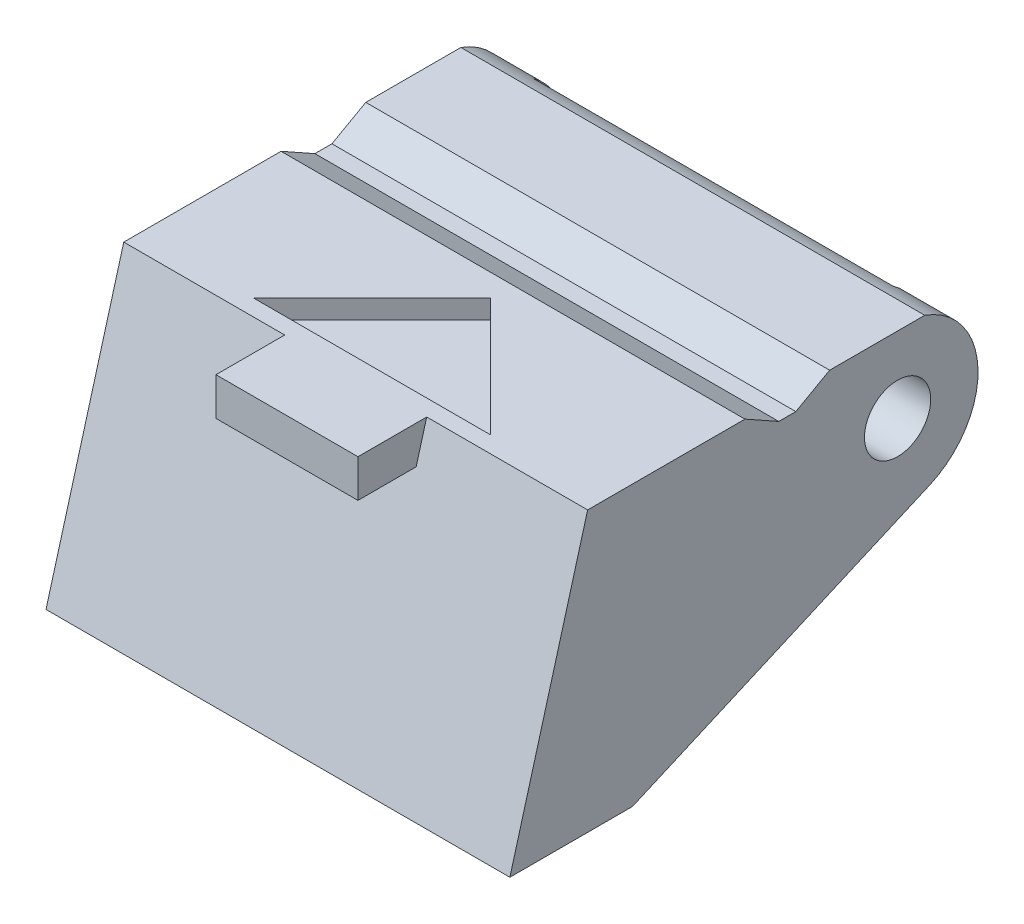
ISO-10303-21;
HEADER;
FILE_DESCRIPTION(('STEP AP214'),'2;1');
FILE_NAME('part.step','',(''),(''),'','','');
FILE_SCHEMA(('AUTOMOTIVE_DESIGN { 1 0 10303 214 1 1 1 1 }'));
ENDSEC;
DATA;
#1=APPLICATION_CONTEXT('core data for automotive mechanical design processes');
#2=APPLICATION_PROTOCOL_DEFINITION('international standard','automotive_design',2000,#1);
#3=PRODUCT_CONTEXT('',#1,'mechanical');
#4=PRODUCT('Part','Part','',(#3));
#5=PRODUCT_RELATED_PRODUCT_CATEGORY('part','',(#4));
#6=PRODUCT_DEFINITION_FORMATION('','',#4);
#7=PRODUCT_DEFINITION_CONTEXT('part definition',#1,'design');
#8=PRODUCT_DEFINITION('design','',#6,#7);
#9=PRODUCT_DEFINITION_SHAPE('','',#8);
#10=(LENGTH_UNIT() NAMED_UNIT(*) SI_UNIT(.MILLI.,.METRE.));
#11=(NAMED_UNIT(*) PLANE_ANGLE_UNIT() SI_UNIT($,.RADIAN.));
#12=(NAMED_UNIT(*) SI_UNIT($,.STERADIAN.) SOLID_ANGLE_UNIT());
#13=UNCERTAINTY_MEASURE_WITH_UNIT(LENGTH_MEASURE(1.E-05),#10,'distance_accuracy_value','');
#14=(GEOMETRIC_REPRESENTATION_CONTEXT(3) GLOBAL_UNCERTAINTY_ASSIGNED_CONTEXT((#13)) GLOBAL_UNIT_ASSIGNED_CONTEXT((#10,
#11,#12)) REPRESENTATION_CONTEXT('',''));
#15=CARTESIAN_POINT('',(0.,0.,0.));
#16=DIRECTION('',(0.,0.,1.));
#17=DIRECTION('',(1.,0.,0.));
#18=AXIS2_PLACEMENT_3D('',#15,#16,#17);
#19=CARTESIAN_POINT('',(4.9,1.6,-1.7));
#20=DIRECTION('',(0.,-1.,0.));
#21=DIRECTION('',(0.,0.,-1.));
#22=AXIS2_PLACEMENT_3D('',#19,#20,#21);
#23=PLANE('',#22);
#24=DIRECTION('',(0.,0.,1.));
#25=VECTOR('',#24,1.);
#26=CARTESIAN_POINT('',(-4.9,1.6,-1.7));
#27=LINE('',#26,#25);
#28=CARTESIAN_POINT('',(-4.9,1.6,-0.574456264653803));
#29=VERTEX_POINT('',#28);
#30=CARTESIAN_POINT('',(-4.9,1.6,1.435));
#31=VERTEX_POINT('',#30);
#32=EDGE_CURVE('E188',#29,#31,#27,.T.);
#33=ORIENTED_EDGE('',*,*,#32,.T.);
#34=DIRECTION('',(1.,0.,0.));
#35=VECTOR('',#34,1.);
#36=CARTESIAN_POINT('',(-5.,1.6,1.435));
#37=LINE('',#36,#35);
#38=CARTESIAN_POINT('',(4.9,1.6,1.435));
#39=VERTEX_POINT('',#38);
#40=EDGE_CURVE('E293',#31,#39,#37,.T.);
#41=ORIENTED_EDGE('',*,*,#40,.T.);
#42=DIRECTION('',(0.,0.,1.));
#43=VECTOR('',#42,1.);
#44=CARTESIAN_POINT('',(4.9,1.6,-1.7));
#45=LINE('',#44,#43);
#46=CARTESIAN_POINT('',(4.9,1.6,-0.574456264653803));
#47=VERTEX_POINT('',#46);
#48=EDGE_CURVE('E278',#47,#39,#45,.T.);
#49=ORIENTED_EDGE('',*,*,#48,.F.);
#50=DIRECTION('',(-1.,0.,0.));
#51=VECTOR('',#50,1.);
#52=CARTESIAN_POINT('',(4.9,1.6,-0.574456264653803));
#53=LINE('',#52,#51);
#54=EDGE_CURVE('E265',#47,#29,#53,.T.);
#55=ORIENTED_EDGE('',*,*,#54,.T.);
#56=EDGE_LOOP('',(#33,#41,#49,#55));
#57=FACE_BOUND('',#56,.T.);
#58=ADVANCED_FACE('F16',(#57),#23,.F.);
#59=CARTESIAN_POINT('',(4.9,0.,0.));
#60=DIRECTION('',(-1.,0.,0.));
#61=DIRECTION('',(0.,0.,1.));
#62=AXIS2_PLACEMENT_3D('',#59,#60,#61);
#63=CYLINDRICAL_SURFACE('',#62,1.7);
#64=CARTESIAN_POINT('',(3.8,0.,0.));
#65=DIRECTION('',(1.,0.,0.));
#66=DIRECTION('',(0.,0.,-1.));
#67=AXIS2_PLACEMENT_3D('',#64,#65,#66);
#68=CIRCLE('',#67,1.7);
#69=CARTESIAN_POINT('',(3.8,-1.55797498876303,-0.680230794943039));
#70=VERTEX_POINT('',#69);
#71=CARTESIAN_POINT('',(3.8,1.38081445189058,-0.991640786499881));
#72=VERTEX_POINT('',#71);
#73=EDGE_CURVE('E255',#70,#72,#68,.T.);
#74=ORIENTED_EDGE('',*,*,#73,.T.);
#75=DIRECTION('',(-1.,0.,0.));
#76=VECTOR('',#75,1.);
#77=CARTESIAN_POINT('',(3.8,1.38081445189058,-0.991640786499881));
#78=LINE('',#77,#76);
#79=CARTESIAN_POINT('',(-3.8,1.38081445189058,-0.991640786499881));
#80=VERTEX_POINT('',#79);
#81=EDGE_CURVE('E232',#72,#80,#78,.T.);
#82=ORIENTED_EDGE('',*,*,#81,.T.);
#83=CARTESIAN_POINT('',(-3.8,0.,0.));
#84=DIRECTION('',(1.,0.,0.));
#85=DIRECTION('',(0.,0.,-1.));
#86=AXIS2_PLACEMENT_3D('',#83,#84,#85);
#87=CIRCLE('',#86,1.7);
#88=CARTESIAN_POINT('',(-3.8,-1.55797498876303,-0.680230794943039));
#89=VERTEX_POINT('',#88);
#90=EDGE_CURVE('E338',#89,#80,#87,.T.);
#91=ORIENTED_EDGE('',*,*,#90,.F.);
#92=DIRECTION('',(1.,0.,0.));
#93=VECTOR('',#92,1.);
#94=CARTESIAN_POINT('',(-4.9,-1.55797498876303,-0.680230794943039));
#95=LINE('',#94,#93);
#96=CARTESIAN_POINT('',(-4.9,-1.55797498876303,-0.680230794943039));
#97=VERTEX_POINT('',#96);
#98=EDGE_CURVE('E189',#97,#89,#95,.T.);
#99=ORIENTED_EDGE('',*,*,#98,.F.);
#100=CARTESIAN_POINT('',(-4.9,0.,0.));
#101=DIRECTION('',(-1.,0.,0.));
#102=DIRECTION('',(0.,0.,-1.));
#103=AXIS2_PLACEMENT_3D('',#100,#101,#102);
#104=CIRCLE('',#103,1.7);
#105=EDGE_CURVE('E347',#29,#97,#104,.T.);
#106=ORIENTED_EDGE('',*,*,#105,.F.);
#107=ORIENTED_EDGE('',*,*,#54,.F.);
#108=CARTESIAN_POINT('',(4.9,0.,0.));
#109=DIRECTION('',(-1.,0.,0.));
#110=DIRECTION('',(0.,0.,-1.));
#111=AXIS2_PLACEMENT_3D('',#108,#109,#110);
#112=CIRCLE('',#111,1.7);
#113=CARTESIAN_POINT('',(4.9,-1.55797498876303,-0.680230794943039));
#114=VERTEX_POINT('',#113);
#115=EDGE_CURVE('E267',#47,#114,#112,.T.);
#116=ORIENTED_EDGE('',*,*,#115,.T.);
#117=DIRECTION('',(-1.,0.,0.));
#118=VECTOR('',#117,1.);
#119=CARTESIAN_POINT('',(4.9,-1.55797498876303,-0.680230794943039));
#120=LINE('',#119,#118);
#121=EDGE_CURVE('E275',#114,#70,#120,.T.);
#122=ORIENTED_EDGE('',*,*,#121,.T.);
#123=EDGE_LOOP('',(#74,#82,#91,#99,#106,#107,#116,#122));
#124=FACE_BOUND('',#123,.T.);
#125=ADVANCED_FACE('F387',(#124),#63,.T.);
#126=CARTESIAN_POINT('',(3.8,0.799999999999999,5.94));
#127=DIRECTION('',(0.,-1.,0.));
#128=DIRECTION('',(0.,0.,-1.));
#129=AXIS2_PLACEMENT_3D('',#126,#127,#128);
#130=PLANE('',#129);
#131=DIRECTION('',(-1.,0.,0.));
#132=VECTOR('',#131,1.);
#133=CARTESIAN_POINT('',(3.8,0.799999999999999,5.94));
#134=LINE('',#133,#132);
#135=CARTESIAN_POINT('',(3.8,0.799999999999999,5.94));
#136=VERTEX_POINT('',#135);
#137=CARTESIAN_POINT('',(-3.8,0.799999999999999,5.94));
#138=VERTEX_POINT('',#137);
#139=EDGE_CURVE('E263',#136,#138,#134,.T.);
#140=ORIENTED_EDGE('',*,*,#139,.T.);
#141=DIRECTION('',(0.,0.,1.));
#142=VECTOR('',#141,1.);
#143=CARTESIAN_POINT('',(-3.8,0.799999999999999,5.94));
#144=LINE('',#143,#142);
#145=CARTESIAN_POINT('',(-3.8,0.799999999999999,0.0143593539448927));
#146=VERTEX_POINT('',#145);
#147=EDGE_CURVE('E341',#146,#138,#144,.T.);
#148=ORIENTED_EDGE('',*,*,#147,.F.);
#149=DIRECTION('',(-1.,0.,0.));
#150=VECTOR('',#149,1.);
#151=CARTESIAN_POINT('',(3.8,0.799999999999999,0.0143593539448927));
#152=LINE('',#151,#150);
#153=CARTESIAN_POINT('',(3.8,0.799999999999999,0.0143593539448927));
#154=VERTEX_POINT('',#153);
#155=EDGE_CURVE('E230',#154,#146,#152,.T.);
#156=ORIENTED_EDGE('',*,*,#155,.F.);
#157=DIRECTION('',(0.,0.,1.));
#158=VECTOR('',#157,1.);
#159=CARTESIAN_POINT('',(3.8,0.799999999999999,5.94));
#160=LINE('',#159,#158);
#161=EDGE_CURVE('E257',#154,#136,#160,.T.);
#162=ORIENTED_EDGE('',*,*,#161,.T.);
#163=EDGE_LOOP('',(#140,#148,#156,#162));
#164=FACE_BOUND('',#163,.T.);
#165=ADVANCED_FACE('F393',(#164),#130,.T.);
#166=CARTESIAN_POINT('',(4.9,1.6,-1.7));
#167=DIRECTION('',(-1.,0.,0.));
#168=DIRECTION('',(0.,0.,1.));
#169=AXIS2_PLACEMENT_3D('',#166,#167,#168);
#170=PLANE('',#169);
#171=ORIENTED_EDGE('',*,*,#48,.T.);
#172=DIRECTION('',(0.,-0.488231650079598,0.872714074517281));
#173=VECTOR('',#172,1.);
#174=CARTESIAN_POINT('',(4.9,2.93578159335544,-0.952709598122836));
#175=LINE('',#174,#173);
#176=CARTESIAN_POINT('',(4.9,1.2,2.15));
#177=VERTEX_POINT('',#176);
#178=EDGE_CURVE('E302',#39,#177,#175,.T.);
#179=ORIENTED_EDGE('',*,*,#178,.T.);
#180=DIRECTION('',(0.,0.,1.));
#181=VECTOR('',#180,1.);
#182=CARTESIAN_POINT('',(4.9,1.2,-1.7));
#183=LINE('',#182,#181);
#184=CARTESIAN_POINT('',(4.9,1.2,2.51));
#185=VERTEX_POINT('',#184);
#186=EDGE_CURVE('E290',#177,#185,#183,.T.);
#187=ORIENTED_EDGE('',*,*,#186,.T.);
#188=DIRECTION('',(0.,0.488231650079598,0.872714074517281));
#189=VECTOR('',#188,1.);
#190=CARTESIAN_POINT('',(4.9,-0.498476665797609,-0.526027040113224));
#191=LINE('',#190,#189);
#192=CARTESIAN_POINT('',(4.9,1.6,3.225));
#193=VERTEX_POINT('',#192);
#194=EDGE_CURVE('E296',#185,#193,#191,.T.);
#195=ORIENTED_EDGE('',*,*,#194,.T.);
#196=CARTESIAN_POINT('',(4.9,1.6,6.54768574116445));
#197=VERTEX_POINT('',#196);
#198=EDGE_CURVE('E180',#193,#197,#45,.T.);
#199=ORIENTED_EDGE('',*,*,#198,.T.);
#200=DIRECTION('',(0.,0.963355359932388,-0.268228355118429));
#201=VECTOR('',#200,1.);
#202=CARTESIAN_POINT('',(4.9,0.799999999999999,6.77043083920366));
#203=LINE('',#202,#201);
#204=CARTESIAN_POINT('',(4.9,-4.3,8.19043083920366));
#205=VERTEX_POINT('',#204);
#206=EDGE_CURVE('E242',#205,#197,#203,.T.);
#207=ORIENTED_EDGE('',*,*,#206,.F.);
#208=DIRECTION('',(0.,0.,-1.));
#209=VECTOR('',#208,1.);
#210=CARTESIAN_POINT('',(4.9,-4.3,-1.7));
#211=LINE('',#210,#209);
#212=CARTESIAN_POINT('',(4.9,-4.3,5.6));
#213=VERTEX_POINT('',#212);
#214=EDGE_CURVE('E172',#205,#213,#211,.T.);
#215=ORIENTED_EDGE('',*,*,#214,.T.);
#216=DIRECTION('',(0.,-0.4001357617312,0.916455875742958));
#217=VECTOR('',#216,1.);
#218=CARTESIAN_POINT('',(4.9,-4.3,5.6));
#219=LINE('',#218,#217);
#220=EDGE_CURVE('E269',#114,#213,#219,.T.);
#221=ORIENTED_EDGE('',*,*,#220,.F.);
#222=ORIENTED_EDGE('',*,*,#115,.F.);
#223=EDGE_LOOP('',(#171,#179,#187,#195,#199,#207,#215,#221,#222));
#224=FACE_BOUND('',#223,.T.);
#225=CARTESIAN_POINT('',(4.9,0.,0.));
#226=DIRECTION('',(1.,0.,0.));
#227=DIRECTION('',(0.,0.,-1.));
#228=AXIS2_PLACEMENT_3D('',#225,#226,#227);
#229=CIRCLE('',#228,0.7);
#230=CARTESIAN_POINT('',(4.9,0.,-0.7));
#231=VERTEX_POINT('',#230);
#232=EDGE_CURVE('E234',#231,#231,#229,.T.);
#233=ORIENTED_EDGE('',*,*,#232,.F.);
#234=EDGE_LOOP('',(#233));
#235=FACE_BOUND('',#234,.T.);
#236=ADVANCED_FACE('F379',(#224,#235),#170,.F.);
#237=CARTESIAN_POINT('',(3.8,0.,0.));
#238=DIRECTION('',(1.,0.,0.));
#239=DIRECTION('',(0.,0.,-1.));
#240=AXIS2_PLACEMENT_3D('',#237,#238,#239);
#241=PLANE('',#240);
#242=DIRECTION('',(0.,0.,-1.));
#243=VECTOR('',#242,1.);
#244=CARTESIAN_POINT('',(3.8,-4.3,7.36));
#245=LINE('',#244,#243);
#246=CARTESIAN_POINT('',(3.8,-4.3,7.36));
#247=VERTEX_POINT('',#246);
#248=CARTESIAN_POINT('',(3.8,-4.3,5.6));
#249=VERTEX_POINT('',#248);
#250=EDGE_CURVE('E249',#247,#249,#245,.T.);
#251=ORIENTED_EDGE('',*,*,#250,.F.);
#252=DIRECTION('',(0.,-0.963355359932388,0.268228355118429));
#253=VECTOR('',#252,1.);
#254=CARTESIAN_POINT('',(3.8,-4.3,7.36));
#255=LINE('',#254,#253);
#256=EDGE_CURVE('E259',#136,#247,#255,.T.);
#257=ORIENTED_EDGE('',*,*,#256,.F.);
#258=ORIENTED_EDGE('',*,*,#161,.F.);
#259=DIRECTION('',(0.,-0.499999999999995,0.866025403784441));
#260=VECTOR('',#259,1.);
#261=CARTESIAN_POINT('',(3.8,0.799999999999999,0.0143593539448927));
#262=LINE('',#261,#260);
#263=EDGE_CURVE('E228',#72,#154,#262,.T.);
#264=ORIENTED_EDGE('',*,*,#263,.F.);
#265=ORIENTED_EDGE('',*,*,#73,.F.);
#266=DIRECTION('',(0.,0.4001357617312,-0.916455875742958));
#267=VECTOR('',#266,1.);
#268=CARTESIAN_POINT('',(3.8,-1.55797498876303,-0.680230794943039));
#269=LINE('',#268,#267);
#270=EDGE_CURVE('E252',#249,#70,#269,.T.);
#271=ORIENTED_EDGE('',*,*,#270,.F.);
#272=EDGE_LOOP('',(#251,#257,#258,#264,#265,#271));
#273=FACE_BOUND('',#272,.T.);
#274=CARTESIAN_POINT('',(3.8,0.,0.));
#275=DIRECTION('',(1.,0.,0.));
#276=DIRECTION('',(0.,0.,-1.));
#277=AXIS2_PLACEMENT_3D('',#274,#275,#276);
#278=CIRCLE('',#277,0.7);
#279=CARTESIAN_POINT('',(3.8,0.,-0.7));
#280=VERTEX_POINT('',#279);
#281=EDGE_CURVE('E237',#280,#280,#278,.F.);
#282=ORIENTED_EDGE('',*,*,#281,.F.);
#283=EDGE_LOOP('',(#282));
#284=FACE_BOUND('',#283,.T.);
#285=ADVANCED_FACE('F396',(#273,#284),#241,.F.);
#286=DIRECTION('',(0.707106781186548,0.,-0.707106781186548));
#287=VECTOR('',#286,1.);
#288=CARTESIAN_POINT('',(0.,1.6,3.7));
#289=LINE('',#288,#287);
#290=CARTESIAN_POINT('',(-2.5,1.6,6.2));
#291=VERTEX_POINT('',#290);
#292=CARTESIAN_POINT('',(0.,1.6,3.7));
#293=VERTEX_POINT('',#292);
#294=EDGE_CURVE('E304',#291,#293,#289,.T.);
#295=ORIENTED_EDGE('',*,*,#294,.T.);
#296=DIRECTION('',(-0.707106781186548,0.,-0.707106781186548));
#297=VECTOR('',#296,1.);
#298=CARTESIAN_POINT('',(0.,1.6,3.7));
#299=LINE('',#298,#297);
#300=CARTESIAN_POINT('',(2.5,1.6,6.2));
#301=VERTEX_POINT('',#300);
#302=EDGE_CURVE('E200',#301,#293,#299,.T.);
#303=ORIENTED_EDGE('',*,*,#302,.F.);
#304=DIRECTION('',(1.,0.,0.));
#305=VECTOR('',#304,1.);
#306=CARTESIAN_POINT('',(2.5,1.6,6.2));
#307=LINE('',#306,#305);
#308=EDGE_CURVE('E207',#291,#301,#307,.T.);
#309=ORIENTED_EDGE('',*,*,#308,.F.);
#310=EDGE_LOOP('',(#295,#303,#309));
#311=FACE_BOUND('',#310,.T.);
#312=ORIENTED_EDGE('',*,*,#198,.F.);
#313=DIRECTION('',(1.,0.,0.));
#314=VECTOR('',#313,1.);
#315=CARTESIAN_POINT('',(-5.,1.6,3.225));
#316=LINE('',#315,#314);
#317=CARTESIAN_POINT('',(-4.9,1.6,3.225));
#318=VERTEX_POINT('',#317);
#319=EDGE_CURVE('E167',#318,#193,#316,.T.);
#320=ORIENTED_EDGE('',*,*,#319,.F.);
#321=CARTESIAN_POINT('',(-4.9,1.6,6.54768574116444));
#322=VERTEX_POINT('',#321);
#323=EDGE_CURVE('E177',#318,#322,#27,.T.);
#324=ORIENTED_EDGE('',*,*,#323,.T.);
#325=DIRECTION('',(-1.,0.,0.));
#326=VECTOR('',#325,1.);
#327=CARTESIAN_POINT('',(-1.5,1.6,6.54768574116445));
#328=LINE('',#327,#326);
#329=CARTESIAN_POINT('',(-1.5,1.6,6.54768574116445));
#330=VERTEX_POINT('',#329);
#331=EDGE_CURVE('E325',#330,#322,#328,.T.);
#332=ORIENTED_EDGE('',*,*,#331,.F.);
#333=DIRECTION('',(0.,0.,1.));
#334=VECTOR('',#333,1.);
#335=CARTESIAN_POINT('',(-1.5,1.6,6.54768574116445));
#336=LINE('',#335,#334);
#337=CARTESIAN_POINT('',(-1.5,1.6,8.));
#338=VERTEX_POINT('',#337);
#339=EDGE_CURVE('E319',#330,#338,#336,.T.);
#340=ORIENTED_EDGE('',*,*,#339,.T.);
#341=DIRECTION('',(-1.,0.,0.));
#342=VECTOR('',#341,1.);
#343=CARTESIAN_POINT('',(4.9,1.6,8.));
#344=LINE('',#343,#342);
#345=CARTESIAN_POINT('',(1.5,1.6,8.));
#346=VERTEX_POINT('',#345);
#347=EDGE_CURVE('E238',#346,#338,#344,.T.);
#348=ORIENTED_EDGE('',*,*,#347,.F.);
#349=DIRECTION('',(0.,0.,1.));
#350=VECTOR('',#349,1.);
#351=CARTESIAN_POINT('',(1.5,1.6,6.54768574116445));
#352=LINE('',#351,#350);
#353=CARTESIAN_POINT('',(1.5,1.6,6.54768574116445));
#354=VERTEX_POINT('',#353);
#355=EDGE_CURVE('E39',#354,#346,#352,.T.);
#356=ORIENTED_EDGE('',*,*,#355,.F.);
#357=DIRECTION('',(1.,0.,0.));
#358=VECTOR('',#357,1.);
#359=CARTESIAN_POINT('',(1.5,1.6,6.54768574116445));
#360=LINE('',#359,#358);
#361=EDGE_CURVE('E226',#354,#197,#360,.T.);
#362=ORIENTED_EDGE('',*,*,#361,.T.);
#363=EDGE_LOOP('',(#312,#320,#324,#332,#340,#348,#356,#362));
#364=FACE_BOUND('',#363,.T.);
#365=ADVANCED_FACE('F18',(#311,#364),#23,.F.);
#366=CARTESIAN_POINT('',(4.9,0.799999999999999,6.77043083920366));
#367=DIRECTION('',(0.,-1.,0.));
#368=DIRECTION('',(0.,0.,-1.));
#369=AXIS2_PLACEMENT_3D('',#366,#367,#368);
#370=PLANE('',#369);
#371=DIRECTION('',(0.,0.,-1.));
#372=VECTOR('',#371,1.);
#373=CARTESIAN_POINT('',(1.5,0.799999999999999,6.77043083920366));
#374=LINE('',#373,#372);
#375=CARTESIAN_POINT('',(1.5,0.799999999999999,8.));
#376=VERTEX_POINT('',#375);
#377=CARTESIAN_POINT('',(1.5,0.799999999999999,6.77043083920366));
#378=VERTEX_POINT('',#377);
#379=EDGE_CURVE('E218',#376,#378,#374,.T.);
#380=ORIENTED_EDGE('',*,*,#379,.F.);
#381=DIRECTION('',(-1.,0.,0.));
#382=VECTOR('',#381,1.);
#383=CARTESIAN_POINT('',(4.9,0.799999999999999,8.));
#384=LINE('',#383,#382);
#385=CARTESIAN_POINT('',(-1.5,0.799999999999999,8.));
#386=VERTEX_POINT('',#385);
#387=EDGE_CURVE('E240',#376,#386,#384,.T.);
#388=ORIENTED_EDGE('',*,*,#387,.T.);
#389=DIRECTION('',(0.,0.,-1.));
#390=VECTOR('',#389,1.);
#391=CARTESIAN_POINT('',(-1.5,0.799999999999999,6.77043083920366));
#392=LINE('',#391,#390);
#393=CARTESIAN_POINT('',(-1.5,0.799999999999999,6.77043083920366));
#394=VERTEX_POINT('',#393);
#395=EDGE_CURVE('E312',#386,#394,#392,.T.);
#396=ORIENTED_EDGE('',*,*,#395,.T.);
#397=DIRECTION('',(-1.,0.,0.));
#398=VECTOR('',#397,1.);
#399=CARTESIAN_POINT('',(4.9,0.799999999999999,6.77043083920366));
#400=LINE('',#399,#398);
#401=EDGE_CURVE('E245',#378,#394,#400,.T.);
#402=ORIENTED_EDGE('',*,*,#401,.F.);
#403=EDGE_LOOP('',(#380,#388,#396,#402));
#404=FACE_BOUND('',#403,.T.);
#405=ADVANCED_FACE('F420',(#404),#370,.T.);
#406=CARTESIAN_POINT('',(4.9,-4.3,-1.7));
#407=DIRECTION('',(0.,1.,0.));
#408=DIRECTION('',(0.,0.,1.));
#409=AXIS2_PLACEMENT_3D('',#406,#407,#408);
#410=PLANE('',#409);
#411=DIRECTION('',(-1.,0.,0.));
#412=VECTOR('',#411,1.);
#413=CARTESIAN_POINT('',(4.9,-4.3,8.19043083920366));
#414=LINE('',#413,#412);
#415=CARTESIAN_POINT('',(-4.9,-4.3,8.19043083920366));
#416=VERTEX_POINT('',#415);
#417=EDGE_CURVE('E247',#205,#416,#414,.T.);
#418=ORIENTED_EDGE('',*,*,#417,.T.);
#419=DIRECTION('',(0.,0.,-1.));
#420=VECTOR('',#419,1.);
#421=CARTESIAN_POINT('',(-4.9,-4.3,-1.7));
#422=LINE('',#421,#420);
#423=CARTESIAN_POINT('',(-4.9,-4.3,5.6));
#424=VERTEX_POINT('',#423);
#425=EDGE_CURVE('E192',#416,#424,#422,.T.);
#426=ORIENTED_EDGE('',*,*,#425,.T.);
#427=DIRECTION('',(1.,0.,0.));
#428=VECTOR('',#427,1.);
#429=CARTESIAN_POINT('',(-4.9,-4.3,5.6));
#430=LINE('',#429,#428);
#431=CARTESIAN_POINT('',(-3.8,-4.3,5.6));
#432=VERTEX_POINT('',#431);
#433=EDGE_CURVE('E194',#424,#432,#430,.T.);
#434=ORIENTED_EDGE('',*,*,#433,.T.);
#435=DIRECTION('',(0.,0.,-1.));
#436=VECTOR('',#435,1.);
#437=CARTESIAN_POINT('',(-3.8,-4.3,7.36));
#438=LINE('',#437,#436);
#439=CARTESIAN_POINT('',(-3.8,-4.3,7.36));
#440=VERTEX_POINT('',#439);
#441=EDGE_CURVE('E333',#440,#432,#438,.T.);
#442=ORIENTED_EDGE('',*,*,#441,.F.);
#443=DIRECTION('',(-1.,0.,0.));
#444=VECTOR('',#443,1.);
#445=CARTESIAN_POINT('',(3.8,-4.3,7.36));
#446=LINE('',#445,#444);
#447=EDGE_CURVE('E261',#247,#440,#446,.T.);
#448=ORIENTED_EDGE('',*,*,#447,.F.);
#449=ORIENTED_EDGE('',*,*,#250,.T.);
#450=DIRECTION('',(-1.,0.,0.));
#451=VECTOR('',#450,1.);
#452=CARTESIAN_POINT('',(4.9,-4.3,5.6));
#453=LINE('',#452,#451);
#454=EDGE_CURVE('E272',#213,#249,#453,.T.);
#455=ORIENTED_EDGE('',*,*,#454,.F.);
#456=ORIENTED_EDGE('',*,*,#214,.F.);
#457=EDGE_LOOP('',(#418,#426,#434,#442,#448,#449,#455,#456));
#458=FACE_BOUND('',#457,.T.);
#459=ADVANCED_FACE('F355',(#458),#410,.F.);
#460=CARTESIAN_POINT('',(4.9,-4.3,5.6));
#461=DIRECTION('',(0.,-0.916455875742958,-0.4001357617312));
#462=DIRECTION('',(0.,0.4001357617312,-0.916455875742958));
#463=AXIS2_PLACEMENT_3D('',#460,#461,#462);
#464=PLANE('',#463);
#465=ORIENTED_EDGE('',*,*,#270,.T.);
#466=ORIENTED_EDGE('',*,*,#121,.F.);
#467=ORIENTED_EDGE('',*,*,#220,.T.);
#468=ORIENTED_EDGE('',*,*,#454,.T.);
#469=EDGE_LOOP('',(#465,#466,#467,#468));
#470=FACE_BOUND('',#469,.T.);
#471=ADVANCED_FACE('F375',(#470),#464,.T.);
#472=CARTESIAN_POINT('',(3.8,-4.3,7.36));
#473=DIRECTION('',(0.,-0.268228355118429,-0.963355359932388));
#474=DIRECTION('',(0.,0.963355359932389,-0.268228355118429));
#475=AXIS2_PLACEMENT_3D('',#472,#473,#474);
#476=PLANE('',#475);
#477=ORIENTED_EDGE('',*,*,#447,.T.);
#478=DIRECTION('',(0.,-0.963355359932388,0.268228355118429));
#479=VECTOR('',#478,1.);
#480=CARTESIAN_POINT('',(-3.8,-4.3,7.36));
#481=LINE('',#480,#479);
#482=EDGE_CURVE('E344',#138,#440,#481,.T.);
#483=ORIENTED_EDGE('',*,*,#482,.F.);
#484=ORIENTED_EDGE('',*,*,#139,.F.);
#485=ORIENTED_EDGE('',*,*,#256,.T.);
#486=EDGE_LOOP('',(#477,#483,#484,#485));
#487=FACE_BOUND('',#486,.T.);
#488=ADVANCED_FACE('F368',(#487),#476,.T.);
#489=CARTESIAN_POINT('',(4.9,0.799999999999999,6.77043083920366));
#490=DIRECTION('',(0.,0.268228355118429,0.963355359932388));
#491=DIRECTION('',(0.,-0.963355359932389,0.268228355118429));
#492=AXIS2_PLACEMENT_3D('',#489,#490,#491);
#493=PLANE('',#492);
#494=ORIENTED_EDGE('',*,*,#401,.T.);
#495=DIRECTION('',(0.,0.963355359932388,-0.268228355118431));
#496=VECTOR('',#495,1.);
#497=CARTESIAN_POINT('',(-1.5,1.6,6.54768574116445));
#498=LINE('',#497,#496);
#499=EDGE_CURVE('E317',#394,#330,#498,.T.);
#500=ORIENTED_EDGE('',*,*,#499,.T.);
#501=ORIENTED_EDGE('',*,*,#331,.T.);
#502=DIRECTION('',(0.,0.963355359932388,-0.268228355118429));
#503=VECTOR('',#502,1.);
#504=CARTESIAN_POINT('',(-4.9,0.799999999999999,6.77043083920366));
#505=LINE('',#504,#503);
#506=EDGE_CURVE('E187',#416,#322,#505,.T.);
#507=ORIENTED_EDGE('',*,*,#506,.F.);
#508=ORIENTED_EDGE('',*,*,#417,.F.);
#509=ORIENTED_EDGE('',*,*,#206,.T.);
#510=ORIENTED_EDGE('',*,*,#361,.F.);
#511=DIRECTION('',(0.,0.963355359932388,-0.268228355118431));
#512=VECTOR('',#511,1.);
#513=CARTESIAN_POINT('',(1.5,1.6,6.54768574116445));
#514=LINE('',#513,#512);
#515=EDGE_CURVE('E221',#378,#354,#514,.T.);
#516=ORIENTED_EDGE('',*,*,#515,.F.);
#517=EDGE_LOOP('',(#494,#500,#501,#507,#508,#509,#510,#516));
#518=FACE_BOUND('',#517,.T.);
#519=ADVANCED_FACE('F384',(#518),#493,.T.);
#520=CARTESIAN_POINT('',(4.9,1.6,8.));
#521=DIRECTION('',(0.,0.,1.));
#522=DIRECTION('',(1.,0.,0.));
#523=AXIS2_PLACEMENT_3D('',#520,#521,#522);
#524=PLANE('',#523);
#525=DIRECTION('',(0.,-1.,0.));
#526=VECTOR('',#525,1.);
#527=CARTESIAN_POINT('',(1.5,0.799999999999999,8.));
#528=LINE('',#527,#526);
#529=EDGE_CURVE('E224',#346,#376,#528,.T.);
#530=ORIENTED_EDGE('',*,*,#529,.F.);
#531=ORIENTED_EDGE('',*,*,#347,.T.);
#532=DIRECTION('',(0.,-1.,0.));
#533=VECTOR('',#532,1.);
#534=CARTESIAN_POINT('',(-1.5,0.799999999999999,8.));
#535=LINE('',#534,#533);
#536=EDGE_CURVE('E322',#338,#386,#535,.T.);
#537=ORIENTED_EDGE('',*,*,#536,.T.);
#538=ORIENTED_EDGE('',*,*,#387,.F.);
#539=EDGE_LOOP('',(#530,#531,#537,#538));
#540=FACE_BOUND('',#539,.T.);
#541=ADVANCED_FACE('F410',(#540),#524,.T.);
#542=CARTESIAN_POINT('',(4.9,0.,0.));
#543=DIRECTION('',(-1.,0.,0.));
#544=DIRECTION('',(0.,0.,1.));
#545=AXIS2_PLACEMENT_3D('',#542,#543,#544);
#546=CYLINDRICAL_SURFACE('',#545,0.7);
#547=ORIENTED_EDGE('',*,*,#232,.T.);
#548=EDGE_LOOP('',(#547));
#549=FACE_BOUND('',#548,.T.);
#550=ORIENTED_EDGE('',*,*,#281,.T.);
#551=EDGE_LOOP('',(#550));
#552=FACE_BOUND('',#551,.T.);
#553=ADVANCED_FACE('F401',(#549,#552),#546,.F.);
#554=CARTESIAN_POINT('',(3.8,0.799999999999999,0.0143593539448927));
#555=DIRECTION('',(0.,-0.866025403784441,-0.499999999999995));
#556=DIRECTION('',(0.,0.499999999999995,-0.866025403784441));
#557=AXIS2_PLACEMENT_3D('',#554,#555,#556);
#558=PLANE('',#557);
#559=ORIENTED_EDGE('',*,*,#155,.T.);
#560=DIRECTION('',(0.,-0.499999999999995,0.866025403784441));
#561=VECTOR('',#560,1.);
#562=CARTESIAN_POINT('',(-3.8,0.799999999999999,0.0143593539448927));
#563=LINE('',#562,#561);
#564=EDGE_CURVE('E327',#80,#146,#563,.T.);
#565=ORIENTED_EDGE('',*,*,#564,.F.);
#566=ORIENTED_EDGE('',*,*,#81,.F.);
#567=ORIENTED_EDGE('',*,*,#263,.T.);
#568=EDGE_LOOP('',(#559,#565,#566,#567));
#569=FACE_BOUND('',#568,.T.);
#570=ADVANCED_FACE('F398',(#569),#558,.T.);
#571=CARTESIAN_POINT('',(1.5,0.799999999999999,8.));
#572=DIRECTION('',(-1.,0.,0.));
#573=DIRECTION('',(0.,0.,1.));
#574=AXIS2_PLACEMENT_3D('',#571,#572,#573);
#575=PLANE('',#574);
#576=ORIENTED_EDGE('',*,*,#379,.T.);
#577=ORIENTED_EDGE('',*,*,#515,.T.);
#578=ORIENTED_EDGE('',*,*,#355,.T.);
#579=ORIENTED_EDGE('',*,*,#529,.T.);
#580=EDGE_LOOP('',(#576,#577,#578,#579));
#581=FACE_BOUND('',#580,.T.);
#582=ADVANCED_FACE('F400',(#581),#575,.F.);
#583=CARTESIAN_POINT('',(0.,1.2,3.7));
#584=DIRECTION('',(0.707106781186548,0.,-0.707106781186548));
#585=DIRECTION('',(-0.707106781186548,0.,-0.707106781186548));
#586=AXIS2_PLACEMENT_3D('',#583,#584,#585);
#587=PLANE('',#586);
#588=ORIENTED_EDGE('',*,*,#302,.T.);
#589=DIRECTION('',(0.,1.,0.));
#590=VECTOR('',#589,1.);
#591=CARTESIAN_POINT('',(0.,1.2,3.7));
#592=LINE('',#591,#590);
#593=CARTESIAN_POINT('',(0.,1.2,3.7));
#594=VERTEX_POINT('',#593);
#595=EDGE_CURVE('E308',#594,#293,#592,.T.);
#596=ORIENTED_EDGE('',*,*,#595,.F.);
#597=DIRECTION('',(-0.707106781186548,0.,-0.707106781186548));
#598=VECTOR('',#597,1.);
#599=CARTESIAN_POINT('',(0.,1.2,3.7));
#600=LINE('',#599,#598);
#601=CARTESIAN_POINT('',(2.5,1.2,6.2));
#602=VERTEX_POINT('',#601);
#603=EDGE_CURVE('E210',#602,#594,#600,.T.);
#604=ORIENTED_EDGE('',*,*,#603,.F.);
#605=DIRECTION('',(0.,1.,0.));
#606=VECTOR('',#605,1.);
#607=CARTESIAN_POINT('',(2.5,1.2,6.2));
#608=LINE('',#607,#606);
#609=EDGE_CURVE('E216',#602,#301,#608,.T.);
#610=ORIENTED_EDGE('',*,*,#609,.T.);
#611=EDGE_LOOP('',(#588,#596,#604,#610));
#612=FACE_BOUND('',#611,.T.);
#613=ADVANCED_FACE('F408',(#612),#587,.F.);
#614=CARTESIAN_POINT('',(2.5,1.2,6.2));
#615=DIRECTION('',(0.,0.,1.));
#616=DIRECTION('',(0.,-1.,0.));
#617=AXIS2_PLACEMENT_3D('',#614,#615,#616);
#618=PLANE('',#617);
#619=ORIENTED_EDGE('',*,*,#308,.T.);
#620=ORIENTED_EDGE('',*,*,#609,.F.);
#621=DIRECTION('',(1.,0.,0.));
#622=VECTOR('',#621,1.);
#623=CARTESIAN_POINT('',(2.5,1.2,6.2));
#624=LINE('',#623,#622);
#625=CARTESIAN_POINT('',(-2.5,1.2,6.2));
#626=VERTEX_POINT('',#625);
#627=EDGE_CURVE('E213',#626,#602,#624,.T.);
#628=ORIENTED_EDGE('',*,*,#627,.F.);
#629=DIRECTION('',(0.,1.,0.));
#630=VECTOR('',#629,1.);
#631=CARTESIAN_POINT('',(-2.5,1.2,6.2));
#632=LINE('',#631,#630);
#633=EDGE_CURVE('E309',#626,#291,#632,.T.);
#634=ORIENTED_EDGE('',*,*,#633,.T.);
#635=EDGE_LOOP('',(#619,#620,#628,#634));
#636=FACE_BOUND('',#635,.T.);
#637=ADVANCED_FACE('F439',(#636),#618,.F.);
#638=CARTESIAN_POINT('',(2.5,1.2,6.2));
#639=DIRECTION('',(0.,-1.,0.));
#640=DIRECTION('',(0.,0.,-1.));
#641=AXIS2_PLACEMENT_3D('',#638,#639,#640);
#642=PLANE('',#641);
#643=ORIENTED_EDGE('',*,*,#603,.T.);
#644=DIRECTION('',(0.707106781186548,0.,-0.707106781186548));
#645=VECTOR('',#644,1.);
#646=CARTESIAN_POINT('',(0.,1.2,3.7));
#647=LINE('',#646,#645);
#648=EDGE_CURVE('E306',#626,#594,#647,.T.);
#649=ORIENTED_EDGE('',*,*,#648,.F.);
#650=ORIENTED_EDGE('',*,*,#627,.T.);
#651=EDGE_LOOP('',(#643,#649,#650));
#652=FACE_BOUND('',#651,.T.);
#653=ADVANCED_FACE('F441',(#652),#642,.F.);
#654=CARTESIAN_POINT('',(-4.9,1.6,-1.7));
#655=DIRECTION('',(1.,0.,0.));
#656=DIRECTION('',(0.,0.,1.));
#657=AXIS2_PLACEMENT_3D('',#654,#655,#656);
#658=PLANE('',#657);
#659=DIRECTION('',(0.,0.,-1.));
#660=VECTOR('',#659,1.);
#661=CARTESIAN_POINT('',(-4.9,1.2,-1.7));
#662=LINE('',#661,#660);
#663=CARTESIAN_POINT('',(-4.9,1.2,2.51));
#664=VERTEX_POINT('',#663);
#665=CARTESIAN_POINT('',(-4.9,1.2,2.15));
#666=VERTEX_POINT('',#665);
#667=EDGE_CURVE('E24',#664,#666,#662,.T.);
#668=ORIENTED_EDGE('',*,*,#667,.T.);
#669=DIRECTION('',(0.,0.488231650079598,-0.872714074517281));
#670=VECTOR('',#669,1.);
#671=CARTESIAN_POINT('',(-4.9,2.93578159335544,-0.952709598122836));
#672=LINE('',#671,#670);
#673=EDGE_CURVE('E10',#666,#31,#672,.T.);
#674=ORIENTED_EDGE('',*,*,#673,.T.);
#675=ORIENTED_EDGE('',*,*,#32,.F.);
#676=ORIENTED_EDGE('',*,*,#105,.T.);
#677=DIRECTION('',(0.,-0.4001357617312,0.916455875742958));
#678=VECTOR('',#677,1.);
#679=CARTESIAN_POINT('',(-4.9,-4.3,5.6));
#680=LINE('',#679,#678);
#681=EDGE_CURVE('E350',#97,#424,#680,.T.);
#682=ORIENTED_EDGE('',*,*,#681,.T.);
#683=ORIENTED_EDGE('',*,*,#425,.F.);
#684=ORIENTED_EDGE('',*,*,#506,.T.);
#685=ORIENTED_EDGE('',*,*,#323,.F.);
#686=DIRECTION('',(0.,-0.488231650079598,-0.872714074517281));
#687=VECTOR('',#686,1.);
#688=CARTESIAN_POINT('',(-4.9,-0.498476665797609,-0.526027040113227));
#689=LINE('',#688,#687);
#690=EDGE_CURVE('E164',#318,#664,#689,.T.);
#691=ORIENTED_EDGE('',*,*,#690,.T.);
#692=EDGE_LOOP('',(#668,#674,#675,#676,#682,#683,#684,#685,#691));
#693=FACE_BOUND('',#692,.T.);
#694=CARTESIAN_POINT('',(-4.9,0.,0.));
#695=DIRECTION('',(1.,0.,0.));
#696=DIRECTION('',(0.,0.,-1.));
#697=AXIS2_PLACEMENT_3D('',#694,#695,#696);
#698=CIRCLE('',#697,0.7);
#699=CARTESIAN_POINT('',(-4.9,0.,-0.7));
#700=VERTEX_POINT('',#699);
#701=EDGE_CURVE('E204',#700,#700,#698,.T.);
#702=ORIENTED_EDGE('',*,*,#701,.T.);
#703=EDGE_LOOP('',(#702));
#704=FACE_BOUND('',#703,.T.);
#705=ADVANCED_FACE('F183',(#693,#704),#658,.F.);
#706=CARTESIAN_POINT('',(-3.8,0.,0.));
#707=DIRECTION('',(-1.,0.,0.));
#708=DIRECTION('',(0.,0.,-1.));
#709=AXIS2_PLACEMENT_3D('',#706,#707,#708);
#710=PLANE('',#709);
#711=ORIENTED_EDGE('',*,*,#441,.T.);
#712=DIRECTION('',(0.,0.4001357617312,-0.916455875742958));
#713=VECTOR('',#712,1.);
#714=CARTESIAN_POINT('',(-3.8,-1.55797498876303,-0.680230794943039));
#715=LINE('',#714,#713);
#716=EDGE_CURVE('E336',#432,#89,#715,.T.);
#717=ORIENTED_EDGE('',*,*,#716,.T.);
#718=ORIENTED_EDGE('',*,*,#90,.T.);
#719=ORIENTED_EDGE('',*,*,#564,.T.);
#720=ORIENTED_EDGE('',*,*,#147,.T.);
#721=ORIENTED_EDGE('',*,*,#482,.T.);
#722=EDGE_LOOP('',(#711,#717,#718,#719,#720,#721));
#723=FACE_BOUND('',#722,.T.);
#724=CARTESIAN_POINT('',(-3.8,0.,0.));
#725=DIRECTION('',(1.,0.,0.));
#726=DIRECTION('',(0.,0.,-1.));
#727=AXIS2_PLACEMENT_3D('',#724,#725,#726);
#728=CIRCLE('',#727,0.7);
#729=CARTESIAN_POINT('',(-3.8,0.,-0.7));
#730=VERTEX_POINT('',#729);
#731=EDGE_CURVE('E201',#730,#730,#728,.F.);
#732=ORIENTED_EDGE('',*,*,#731,.T.);
#733=EDGE_LOOP('',(#732));
#734=FACE_BOUND('',#733,.T.);
#735=ADVANCED_FACE('F362',(#723,#734),#710,.F.);
#736=CARTESIAN_POINT('',(-4.9,-4.3,5.6));
#737=DIRECTION('',(0.,-0.916455875742958,-0.4001357617312));
#738=DIRECTION('',(0.,0.4001357617312,-0.916455875742958));
#739=AXIS2_PLACEMENT_3D('',#736,#737,#738);
#740=PLANE('',#739);
#741=ORIENTED_EDGE('',*,*,#716,.F.);
#742=ORIENTED_EDGE('',*,*,#433,.F.);
#743=ORIENTED_EDGE('',*,*,#681,.F.);
#744=ORIENTED_EDGE('',*,*,#98,.T.);
#745=EDGE_LOOP('',(#741,#742,#743,#744));
#746=FACE_BOUND('',#745,.T.);
#747=ADVANCED_FACE('F358',(#746),#740,.T.);
#748=CARTESIAN_POINT('',(-4.9,0.,0.));
#749=DIRECTION('',(1.,0.,0.));
#750=DIRECTION('',(0.,0.,1.));
#751=AXIS2_PLACEMENT_3D('',#748,#749,#750);
#752=CYLINDRICAL_SURFACE('',#751,0.7);
#753=ORIENTED_EDGE('',*,*,#701,.F.);
#754=EDGE_LOOP('',(#753));
#755=FACE_BOUND('',#754,.T.);
#756=ORIENTED_EDGE('',*,*,#731,.F.);
#757=EDGE_LOOP('',(#756));
#758=FACE_BOUND('',#757,.T.);
#759=ADVANCED_FACE('F496',(#755,#758),#752,.F.);
#760=CARTESIAN_POINT('',(-1.5,0.799999999999999,8.));
#761=DIRECTION('',(1.,0.,0.));
#762=DIRECTION('',(0.,0.,1.));
#763=AXIS2_PLACEMENT_3D('',#760,#761,#762);
#764=PLANE('',#763);
#765=ORIENTED_EDGE('',*,*,#395,.F.);
#766=ORIENTED_EDGE('',*,*,#536,.F.);
#767=ORIENTED_EDGE('',*,*,#339,.F.);
#768=ORIENTED_EDGE('',*,*,#499,.F.);
#769=EDGE_LOOP('',(#765,#766,#767,#768));
#770=FACE_BOUND('',#769,.T.);
#771=ADVANCED_FACE('F504',(#770),#764,.F.);
#772=CARTESIAN_POINT('',(0.,1.2,3.7));
#773=DIRECTION('',(-0.707106781186548,0.,-0.707106781186548));
#774=DIRECTION('',(0.707106781186548,0.,-0.707106781186548));
#775=AXIS2_PLACEMENT_3D('',#772,#773,#774);
#776=PLANE('',#775);
#777=ORIENTED_EDGE('',*,*,#294,.F.);
#778=ORIENTED_EDGE('',*,*,#633,.F.);
#779=ORIENTED_EDGE('',*,*,#648,.T.);
#780=ORIENTED_EDGE('',*,*,#595,.T.);
#781=EDGE_LOOP('',(#777,#778,#779,#780));
#782=FACE_BOUND('',#781,.T.);
#783=ADVANCED_FACE('F434',(#782),#776,.F.);
#784=CARTESIAN_POINT('',(-5.,1.2,2.15));
#785=DIRECTION('',(0.,-0.872714074517281,-0.488231650079598));
#786=DIRECTION('',(0.,0.488231650079598,-0.872714074517281));
#787=AXIS2_PLACEMENT_3D('',#784,#785,#786);
#788=PLANE('',#787);
#789=ORIENTED_EDGE('',*,*,#40,.F.);
#790=ORIENTED_EDGE('',*,*,#673,.F.);
#791=DIRECTION('',(1.,0.,0.));
#792=VECTOR('',#791,1.);
#793=CARTESIAN_POINT('',(-5.,1.2,2.15));
#794=LINE('',#793,#792);
#795=EDGE_CURVE('E289',#666,#177,#794,.T.);
#796=ORIENTED_EDGE('',*,*,#795,.T.);
#797=ORIENTED_EDGE('',*,*,#178,.F.);
#798=EDGE_LOOP('',(#789,#790,#796,#797));
#799=FACE_BOUND('',#798,.T.);
#800=ADVANCED_FACE('F523',(#799),#788,.F.);
#801=CARTESIAN_POINT('',(-5.,1.2,2.51));
#802=DIRECTION('',(0.,-1.,0.));
#803=DIRECTION('',(0.,0.,-1.));
#804=AXIS2_PLACEMENT_3D('',#801,#802,#803);
#805=PLANE('',#804);
#806=ORIENTED_EDGE('',*,*,#795,.F.);
#807=ORIENTED_EDGE('',*,*,#667,.F.);
#808=DIRECTION('',(1.,0.,0.));
#809=VECTOR('',#808,1.);
#810=CARTESIAN_POINT('',(-5.,1.2,2.51));
#811=LINE('',#810,#809);
#812=EDGE_CURVE('E31',#664,#185,#811,.T.);
#813=ORIENTED_EDGE('',*,*,#812,.T.);
#814=ORIENTED_EDGE('',*,*,#186,.F.);
#815=EDGE_LOOP('',(#806,#807,#813,#814));
#816=FACE_BOUND('',#815,.T.);
#817=ADVANCED_FACE('F286',(#816),#805,.F.);
#818=CARTESIAN_POINT('',(-5.,1.6,3.225));
#819=DIRECTION('',(0.,-0.872714074517281,0.488231650079598));
#820=DIRECTION('',(0.,-0.488231650079598,-0.872714074517281));
#821=AXIS2_PLACEMENT_3D('',#818,#819,#820);
#822=PLANE('',#821);
#823=ORIENTED_EDGE('',*,*,#812,.F.);
#824=ORIENTED_EDGE('',*,*,#690,.F.);
#825=ORIENTED_EDGE('',*,*,#319,.T.);
#826=ORIENTED_EDGE('',*,*,#194,.F.);
#827=EDGE_LOOP('',(#823,#824,#825,#826));
#828=FACE_BOUND('',#827,.T.);
#829=ADVANCED_FACE('F166',(#828),#822,.F.);
#830=CLOSED_SHELL('',(#58,#125,#165,#236,#285,#365,#405,#459,#471,#488,#519,#541,#553,#570,#582,
#613,#637,#653,#705,#735,#747,#759,#771,#783,#800,#817,#829));
#831=MANIFOLD_SOLID_BREP('B1',#830);
#832=ADVANCED_BREP_SHAPE_REPRESENTATION('',(#18,#831),#14);
#833=SHAPE_DEFINITION_REPRESENTATION(#9,#832);
ENDSEC;
END-ISO-10303-21;
